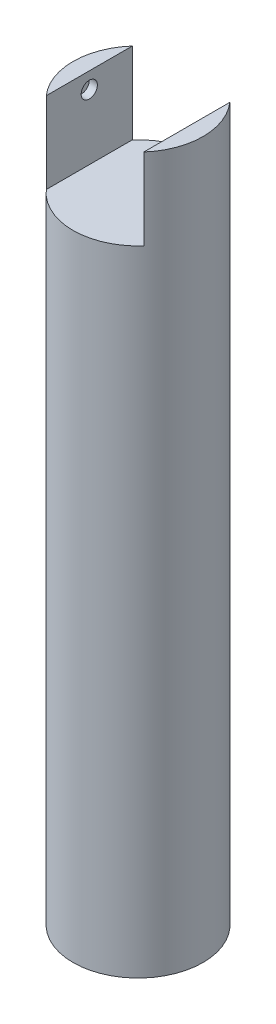
ISO-10303-21;
HEADER;
FILE_DESCRIPTION(('STEP AP214'),'2;1');
FILE_NAME('part.step','',(''),(''),'','','');
FILE_SCHEMA(('AUTOMOTIVE_DESIGN { 1 0 10303 214 1 1 1 1 }'));
ENDSEC;
DATA;
#1=APPLICATION_CONTEXT('core data for automotive mechanical design processes');
#2=APPLICATION_PROTOCOL_DEFINITION('international standard','automotive_design',2000,#1);
#3=PRODUCT_CONTEXT('',#1,'mechanical');
#4=PRODUCT('Part','Part','',(#3));
#5=PRODUCT_RELATED_PRODUCT_CATEGORY('part','',(#4));
#6=PRODUCT_DEFINITION_FORMATION('','',#4);
#7=PRODUCT_DEFINITION_CONTEXT('part definition',#1,'design');
#8=PRODUCT_DEFINITION('design','',#6,#7);
#9=PRODUCT_DEFINITION_SHAPE('','',#8);
#10=(LENGTH_UNIT() NAMED_UNIT(*) SI_UNIT(.MILLI.,.METRE.));
#11=(NAMED_UNIT(*) PLANE_ANGLE_UNIT() SI_UNIT($,.RADIAN.));
#12=(NAMED_UNIT(*) SI_UNIT($,.STERADIAN.) SOLID_ANGLE_UNIT());
#13=UNCERTAINTY_MEASURE_WITH_UNIT(LENGTH_MEASURE(1.E-05),#10,'distance_accuracy_value','');
#14=(GEOMETRIC_REPRESENTATION_CONTEXT(3) GLOBAL_UNCERTAINTY_ASSIGNED_CONTEXT((#13)) GLOBAL_UNIT_ASSIGNED_CONTEXT((#10,
#11,#12)) REPRESENTATION_CONTEXT('',''));
#15=CARTESIAN_POINT('',(0.,0.,0.));
#16=DIRECTION('',(0.,0.,1.));
#17=DIRECTION('',(1.,0.,0.));
#18=AXIS2_PLACEMENT_3D('',#15,#16,#17);
#19=CARTESIAN_POINT('',(0.,220.,0.));
#20=DIRECTION('',(0.,1.,0.));
#21=DIRECTION('',(0.,0.,1.));
#22=AXIS2_PLACEMENT_3D('',#19,#20,#21);
#23=PLANE('',#22);
#24=DIRECTION('',(0.,0.,-1.));
#25=VECTOR('',#24,1.);
#26=CARTESIAN_POINT('',(15.,220.,0.));
#27=LINE('',#26,#25);
#28=CARTESIAN_POINT('',(15.,220.,13.2287565553229));
#29=VERTEX_POINT('',#28);
#30=CARTESIAN_POINT('',(15.,220.,-13.228756555323));
#31=VERTEX_POINT('',#30);
#32=EDGE_CURVE('E80',#29,#31,#27,.T.);
#33=ORIENTED_EDGE('',*,*,#32,.F.);
#34=CARTESIAN_POINT('',(0.,220.,0.));
#35=DIRECTION('',(0.,1.,0.));
#36=DIRECTION('',(0.,0.,1.));
#37=AXIS2_PLACEMENT_3D('',#34,#35,#36);
#38=CIRCLE('',#37,20.);
#39=EDGE_CURVE('E81',#29,#31,#38,.T.);
#40=ORIENTED_EDGE('',*,*,#39,.T.);
#41=EDGE_LOOP('',(#33,#40));
#42=FACE_BOUND('',#41,.T.);
#43=ADVANCED_FACE('F33',(#42),#23,.T.);
#44=CARTESIAN_POINT('',(0.,220.,0.));
#45=DIRECTION('',(0.,-1.,0.));
#46=DIRECTION('',(0.,0.,-1.));
#47=AXIS2_PLACEMENT_3D('',#44,#45,#46);
#48=CYLINDRICAL_SURFACE('',#47,20.);
#49=CARTESIAN_POINT('',(0.,195.,0.));
#50=DIRECTION('',(0.,1.,0.));
#51=DIRECTION('',(0.,0.,1.));
#52=AXIS2_PLACEMENT_3D('',#49,#50,#51);
#53=CIRCLE('',#52,20.);
#54=CARTESIAN_POINT('',(15.,195.,-13.228756555323));
#55=VERTEX_POINT('',#54);
#56=CARTESIAN_POINT('',(-15.,195.,-13.2287565553229));
#57=VERTEX_POINT('',#56);
#58=EDGE_CURVE('E11',#55,#57,#53,.T.);
#59=ORIENTED_EDGE('',*,*,#58,.F.);
#60=DIRECTION('',(0.,-1.,0.));
#61=VECTOR('',#60,1.);
#62=CARTESIAN_POINT('',(15.,220.,-13.228756555323));
#63=LINE('',#62,#61);
#64=EDGE_CURVE('E56',#55,#31,#63,.F.);
#65=ORIENTED_EDGE('',*,*,#64,.T.);
#66=ORIENTED_EDGE('',*,*,#39,.F.);
#67=DIRECTION('',(0.,-1.,0.));
#68=VECTOR('',#67,1.);
#69=CARTESIAN_POINT('',(15.,220.,13.228756555323));
#70=LINE('',#69,#68);
#71=CARTESIAN_POINT('',(15.,195.,13.228756555323));
#72=VERTEX_POINT('',#71);
#73=EDGE_CURVE('E96',#29,#72,#70,.T.);
#74=ORIENTED_EDGE('',*,*,#73,.T.);
#75=CARTESIAN_POINT('',(-15.,195.,13.2287565553229));
#76=VERTEX_POINT('',#75);
#77=EDGE_CURVE('E37',#76,#72,#53,.T.);
#78=ORIENTED_EDGE('',*,*,#77,.F.);
#79=DIRECTION('',(0.,-1.,0.));
#80=VECTOR('',#79,1.);
#81=CARTESIAN_POINT('',(-15.,220.,13.2287565553229));
#82=LINE('',#81,#80);
#83=CARTESIAN_POINT('',(-15.,220.,13.2287565553229));
#84=VERTEX_POINT('',#83);
#85=EDGE_CURVE('E75',#76,#84,#82,.F.);
#86=ORIENTED_EDGE('',*,*,#85,.T.);
#87=CARTESIAN_POINT('',(-15.,220.,-13.2287565553229));
#88=VERTEX_POINT('',#87);
#89=EDGE_CURVE('E87',#88,#84,#38,.T.);
#90=ORIENTED_EDGE('',*,*,#89,.F.);
#91=DIRECTION('',(0.,-1.,0.));
#92=VECTOR('',#91,1.);
#93=CARTESIAN_POINT('',(-15.,220.,-13.2287565553229));
#94=LINE('',#93,#92);
#95=EDGE_CURVE('E48',#88,#57,#94,.T.);
#96=ORIENTED_EDGE('',*,*,#95,.T.);
#97=EDGE_LOOP('',(#59,#65,#66,#74,#78,#86,#90,#96));
#98=FACE_BOUND('',#97,.T.);
#99=CARTESIAN_POINT('',(0.,0.,0.));
#100=DIRECTION('',(0.,1.,0.));
#101=DIRECTION('',(0.,0.,1.));
#102=AXIS2_PLACEMENT_3D('',#99,#100,#101);
#103=CIRCLE('',#102,20.);
#104=CARTESIAN_POINT('',(0.,0.,20.));
#105=VERTEX_POINT('',#104);
#106=EDGE_CURVE('E92',#105,#105,#103,.T.);
#107=ORIENTED_EDGE('',*,*,#106,.T.);
#108=EDGE_LOOP('',(#107));
#109=FACE_BOUND('',#108,.T.);
#110=ADVANCED_FACE('F35',(#98,#109),#48,.T.);
#111=DIRECTION('',(0.,0.,1.));
#112=VECTOR('',#111,1.);
#113=CARTESIAN_POINT('',(-15.,220.,0.));
#114=LINE('',#113,#112);
#115=EDGE_CURVE('E72',#88,#84,#114,.T.);
#116=ORIENTED_EDGE('',*,*,#115,.F.);
#117=ORIENTED_EDGE('',*,*,#89,.T.);
#118=EDGE_LOOP('',(#116,#117));
#119=FACE_BOUND('',#118,.T.);
#120=ADVANCED_FACE('F91',(#119),#23,.T.);
#121=CARTESIAN_POINT('',(0.,0.,0.));
#122=DIRECTION('',(0.,1.,0.));
#123=DIRECTION('',(0.,0.,1.));
#124=AXIS2_PLACEMENT_3D('',#121,#122,#123);
#125=PLANE('',#124);
#126=ORIENTED_EDGE('',*,*,#106,.F.);
#127=EDGE_LOOP('',(#126));
#128=FACE_BOUND('',#127,.T.);
#129=ADVANCED_FACE('F142',(#128),#125,.F.);
#130=CARTESIAN_POINT('',(0.,195.,0.));
#131=DIRECTION('',(0.,1.,0.));
#132=DIRECTION('',(0.,0.,1.));
#133=AXIS2_PLACEMENT_3D('',#130,#131,#132);
#134=PLANE('',#133);
#135=ORIENTED_EDGE('',*,*,#58,.T.);
#136=DIRECTION('',(0.,0.,1.));
#137=VECTOR('',#136,1.);
#138=CARTESIAN_POINT('',(-15.,195.,-20.8906277407883));
#139=LINE('',#138,#137);
#140=EDGE_CURVE('E89',#57,#76,#139,.T.);
#141=ORIENTED_EDGE('',*,*,#140,.T.);
#142=ORIENTED_EDGE('',*,*,#77,.T.);
#143=DIRECTION('',(0.,0.,-1.));
#144=VECTOR('',#143,1.);
#145=CARTESIAN_POINT('',(15.,195.,-20.8906277407883));
#146=LINE('',#145,#144);
#147=EDGE_CURVE('E103',#72,#55,#146,.T.);
#148=ORIENTED_EDGE('',*,*,#147,.T.);
#149=EDGE_LOOP('',(#135,#141,#142,#148));
#150=FACE_BOUND('',#149,.T.);
#151=ADVANCED_FACE('F102',(#150),#134,.T.);
#152=CARTESIAN_POINT('',(15.,195.,-20.8906277407883));
#153=DIRECTION('',(1.,0.,0.));
#154=DIRECTION('',(0.,0.,-1.));
#155=AXIS2_PLACEMENT_3D('',#152,#153,#154);
#156=PLANE('',#155);
#157=CARTESIAN_POINT('',(15.,215.,0.));
#158=DIRECTION('',(1.,0.,0.));
#159=DIRECTION('',(0.,0.,-1.));
#160=AXIS2_PLACEMENT_3D('',#157,#158,#159);
#161=CIRCLE('',#160,2.5);
#162=CARTESIAN_POINT('',(15.,215.,-2.5));
#163=VERTEX_POINT('',#162);
#164=EDGE_CURVE('E117',#163,#163,#161,.T.);
#165=ORIENTED_EDGE('',*,*,#164,.T.);
#166=EDGE_LOOP('',(#165));
#167=FACE_BOUND('',#166,.T.);
#168=ORIENTED_EDGE('',*,*,#32,.T.);
#169=ORIENTED_EDGE('',*,*,#64,.F.);
#170=ORIENTED_EDGE('',*,*,#147,.F.);
#171=ORIENTED_EDGE('',*,*,#73,.F.);
#172=EDGE_LOOP('',(#168,#169,#170,#171));
#173=FACE_BOUND('',#172,.T.);
#174=ADVANCED_FACE('F104',(#167,#173),#156,.F.);
#175=CARTESIAN_POINT('',(-15.,195.,-20.8906277407883));
#176=DIRECTION('',(-1.,0.,0.));
#177=DIRECTION('',(0.,0.,1.));
#178=AXIS2_PLACEMENT_3D('',#175,#176,#177);
#179=PLANE('',#178);
#180=CARTESIAN_POINT('',(-15.,215.,0.));
#181=DIRECTION('',(1.,0.,0.));
#182=DIRECTION('',(0.,0.,-1.));
#183=AXIS2_PLACEMENT_3D('',#180,#181,#182);
#184=CIRCLE('',#183,2.5);
#185=CARTESIAN_POINT('',(-15.,215.,-2.5));
#186=VERTEX_POINT('',#185);
#187=EDGE_CURVE('E111',#186,#186,#184,.T.);
#188=ORIENTED_EDGE('',*,*,#187,.F.);
#189=EDGE_LOOP('',(#188));
#190=FACE_BOUND('',#189,.T.);
#191=ORIENTED_EDGE('',*,*,#115,.T.);
#192=ORIENTED_EDGE('',*,*,#85,.F.);
#193=ORIENTED_EDGE('',*,*,#140,.F.);
#194=ORIENTED_EDGE('',*,*,#95,.F.);
#195=EDGE_LOOP('',(#191,#192,#193,#194));
#196=FACE_BOUND('',#195,.T.);
#197=ADVANCED_FACE('F74',(#190,#196),#179,.F.);
#198=CARTESIAN_POINT('',(-17.5,215.,0.));
#199=DIRECTION('',(1.,0.,0.));
#200=DIRECTION('',(0.,0.,-1.));
#201=AXIS2_PLACEMENT_3D('',#198,#199,#200);
#202=CYLINDRICAL_SURFACE('',#201,2.5);
#203=CARTESIAN_POINT('',(-17.5,215.,0.));
#204=DIRECTION('',(1.,0.,0.));
#205=DIRECTION('',(0.,0.,-1.));
#206=AXIS2_PLACEMENT_3D('',#203,#204,#205);
#207=CIRCLE('',#206,2.5);
#208=CARTESIAN_POINT('',(-17.5,215.,-2.5));
#209=VERTEX_POINT('',#208);
#210=EDGE_CURVE('E105',#209,#209,#207,.T.);
#211=ORIENTED_EDGE('',*,*,#210,.F.);
#212=EDGE_LOOP('',(#211));
#213=FACE_BOUND('',#212,.T.);
#214=ORIENTED_EDGE('',*,*,#187,.T.);
#215=EDGE_LOOP('',(#214));
#216=FACE_BOUND('',#215,.T.);
#217=ADVANCED_FACE('F158',(#213,#216),#202,.F.);
#218=CARTESIAN_POINT('',(-17.5,215.,0.));
#219=DIRECTION('',(1.,0.,0.));
#220=DIRECTION('',(0.,0.,-1.));
#221=AXIS2_PLACEMENT_3D('',#218,#219,#220);
#222=PLANE('',#221);
#223=ORIENTED_EDGE('',*,*,#210,.T.);
#224=EDGE_LOOP('',(#223));
#225=FACE_BOUND('',#224,.T.);
#226=ADVANCED_FACE('F132',(#225),#222,.T.);
#227=CARTESIAN_POINT('',(17.5,215.,0.));
#228=DIRECTION('',(-1.,0.,0.));
#229=DIRECTION('',(0.,0.,1.));
#230=AXIS2_PLACEMENT_3D('',#227,#228,#229);
#231=CYLINDRICAL_SURFACE('',#230,2.5);
#232=CARTESIAN_POINT('',(17.5,215.,0.));
#233=DIRECTION('',(1.,0.,0.));
#234=DIRECTION('',(0.,0.,-1.));
#235=AXIS2_PLACEMENT_3D('',#232,#233,#234);
#236=CIRCLE('',#235,2.5);
#237=CARTESIAN_POINT('',(17.5,215.,-2.5));
#238=VERTEX_POINT('',#237);
#239=EDGE_CURVE('E114',#238,#238,#236,.T.);
#240=ORIENTED_EDGE('',*,*,#239,.T.);
#241=EDGE_LOOP('',(#240));
#242=FACE_BOUND('',#241,.T.);
#243=ORIENTED_EDGE('',*,*,#164,.F.);
#244=EDGE_LOOP('',(#243));
#245=FACE_BOUND('',#244,.T.);
#246=ADVANCED_FACE('F123',(#242,#245),#231,.F.);
#247=CARTESIAN_POINT('',(17.5,215.,0.));
#248=DIRECTION('',(-1.,0.,0.));
#249=DIRECTION('',(0.,0.,-1.));
#250=AXIS2_PLACEMENT_3D('',#247,#248,#249);
#251=PLANE('',#250);
#252=ORIENTED_EDGE('',*,*,#239,.F.);
#253=EDGE_LOOP('',(#252));
#254=FACE_BOUND('',#253,.T.);
#255=ADVANCED_FACE('F126',(#254),#251,.T.);
#256=CLOSED_SHELL('',(#43,#110,#120,#129,#151,#174,#197,#217,#226,#246,#255));
#257=MANIFOLD_SOLID_BREP('B2',#256);
#258=ADVANCED_BREP_SHAPE_REPRESENTATION('',(#18,#257),#14);
#259=SHAPE_DEFINITION_REPRESENTATION(#9,#258);
ENDSEC;
END-ISO-10303-21;
